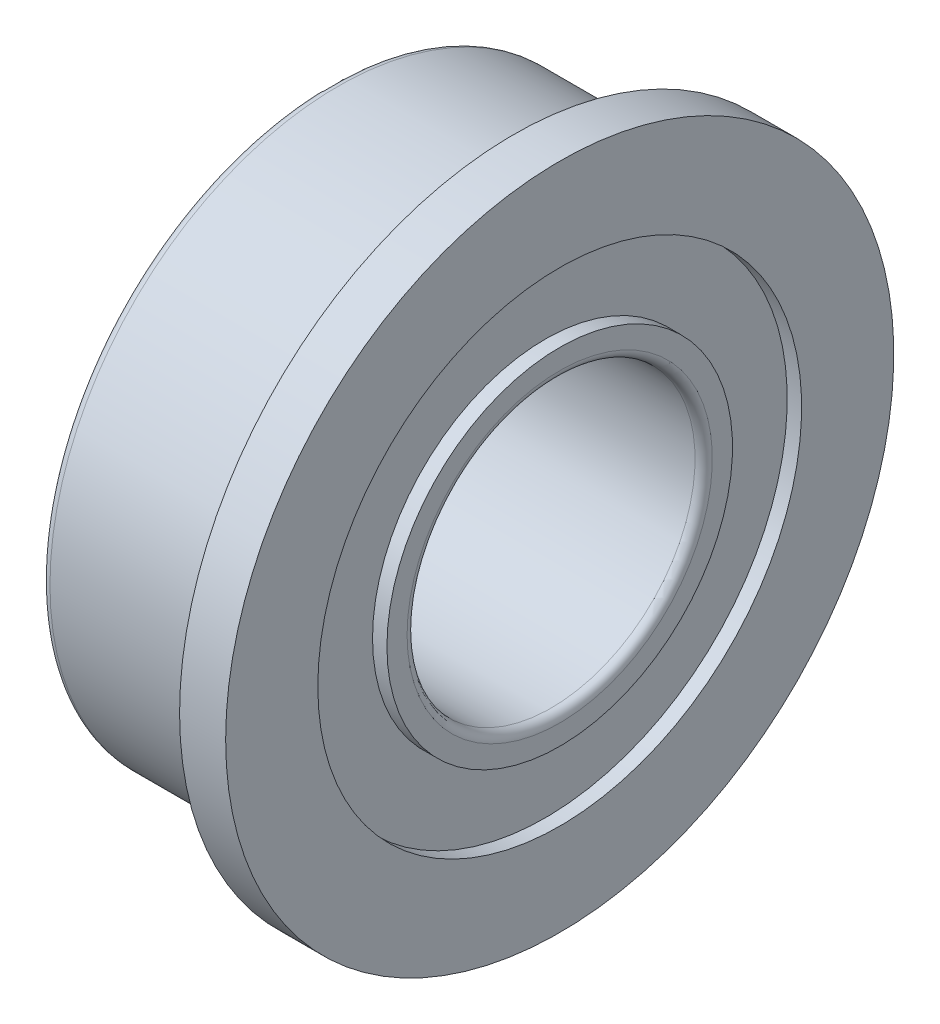
ISO-10303-21;
HEADER;
FILE_DESCRIPTION(('STEP AP214'),'2;1');
FILE_NAME('part.step','',(''),(''),'','','');
FILE_SCHEMA(('AUTOMOTIVE_DESIGN { 1 0 10303 214 1 1 1 1 }'));
ENDSEC;
DATA;
#1=APPLICATION_CONTEXT('core data for automotive mechanical design processes');
#2=APPLICATION_PROTOCOL_DEFINITION('international standard','automotive_design',2000,#1);
#3=PRODUCT_CONTEXT('',#1,'mechanical');
#4=PRODUCT('Part','Part','',(#3));
#5=PRODUCT_RELATED_PRODUCT_CATEGORY('part','',(#4));
#6=PRODUCT_DEFINITION_FORMATION('','',#4);
#7=PRODUCT_DEFINITION_CONTEXT('part definition',#1,'design');
#8=PRODUCT_DEFINITION('design','',#6,#7);
#9=PRODUCT_DEFINITION_SHAPE('','',#8);
#10=(LENGTH_UNIT() NAMED_UNIT(*) SI_UNIT(.MILLI.,.METRE.));
#11=(NAMED_UNIT(*) PLANE_ANGLE_UNIT() SI_UNIT($,.RADIAN.));
#12=(NAMED_UNIT(*) SI_UNIT($,.STERADIAN.) SOLID_ANGLE_UNIT());
#13=UNCERTAINTY_MEASURE_WITH_UNIT(LENGTH_MEASURE(1.E-05),#10,'distance_accuracy_value','');
#14=(GEOMETRIC_REPRESENTATION_CONTEXT(3) GLOBAL_UNCERTAINTY_ASSIGNED_CONTEXT((#13)) GLOBAL_UNIT_ASSIGNED_CONTEXT((#10,
#11,#12)) REPRESENTATION_CONTEXT('',''));
#15=CARTESIAN_POINT('',(0.,0.,0.));
#16=DIRECTION('',(0.,0.,1.));
#17=DIRECTION('',(1.,0.,0.));
#18=AXIS2_PLACEMENT_3D('',#15,#16,#17);
#19=CARTESIAN_POINT('',(-3.2,0.,0.));
#20=DIRECTION('',(-1.,0.,0.));
#21=DIRECTION('',(0.,0.,1.));
#22=AXIS2_PLACEMENT_3D('',#19,#20,#21);
#23=CYLINDRICAL_SURFACE('',#22,5.8);
#24=CARTESIAN_POINT('',(0.,0.,0.));
#25=DIRECTION('',(-1.,0.,0.));
#26=DIRECTION('',(0.,0.,1.));
#27=AXIS2_PLACEMENT_3D('',#24,#25,#26);
#28=CIRCLE('',#27,5.8);
#29=CARTESIAN_POINT('',(0.,0.,5.8));
#30=VERTEX_POINT('',#29);
#31=EDGE_CURVE('E57',#30,#30,#28,.T.);
#32=ORIENTED_EDGE('',*,*,#31,.F.);
#33=EDGE_LOOP('',(#32));
#34=FACE_BOUND('',#33,.T.);
#35=CARTESIAN_POINT('',(0.8,0.,0.));
#36=DIRECTION('',(-1.,0.,0.));
#37=DIRECTION('',(0.,0.,1.));
#38=AXIS2_PLACEMENT_3D('',#35,#36,#37);
#39=CIRCLE('',#38,5.8);
#40=CARTESIAN_POINT('',(0.8,0.,5.8));
#41=VERTEX_POINT('',#40);
#42=EDGE_CURVE('E90',#41,#41,#39,.T.);
#43=ORIENTED_EDGE('',*,*,#42,.T.);
#44=EDGE_LOOP('',(#43));
#45=FACE_BOUND('',#44,.T.);
#46=ADVANCED_FACE('F31',(#34,#45),#23,.T.);
#47=CARTESIAN_POINT('',(0.,5.2,0.));
#48=DIRECTION('',(1.,0.,0.));
#49=DIRECTION('',(0.,0.,-1.));
#50=AXIS2_PLACEMENT_3D('',#47,#48,#49);
#51=PLANE('',#50);
#52=CARTESIAN_POINT('',(0.,0.,0.));
#53=DIRECTION('',(-1.,0.,0.));
#54=DIRECTION('',(0.,0.,1.));
#55=AXIS2_PLACEMENT_3D('',#52,#53,#54);
#56=CIRCLE('',#55,5.2);
#57=CARTESIAN_POINT('',(0.,0.,5.2));
#58=VERTEX_POINT('',#57);
#59=EDGE_CURVE('E60',#58,#58,#56,.T.);
#60=ORIENTED_EDGE('',*,*,#59,.F.);
#61=EDGE_LOOP('',(#60));
#62=FACE_BOUND('',#61,.T.);
#63=ORIENTED_EDGE('',*,*,#31,.T.);
#64=EDGE_LOOP('',(#63));
#65=FACE_BOUND('',#64,.T.);
#66=ADVANCED_FACE('F132',(#62,#65),#51,.F.);
#67=CARTESIAN_POINT('',(0.,0.,0.));
#68=DIRECTION('',(-1.,0.,0.));
#69=DIRECTION('',(0.,0.,1.));
#70=AXIS2_PLACEMENT_3D('',#67,#68,#69);
#71=TOROIDAL_SURFACE('',#70,5.,0.2);
#72=CARTESIAN_POINT('',(-0.2,0.,0.));
#73=DIRECTION('',(-1.,0.,0.));
#74=DIRECTION('',(0.,0.,1.));
#75=AXIS2_PLACEMENT_3D('',#72,#73,#74);
#76=CIRCLE('',#75,5.);
#77=CARTESIAN_POINT('',(-0.2,0.,5.));
#78=VERTEX_POINT('',#77);
#79=EDGE_CURVE('E63',#78,#78,#76,.T.);
#80=ORIENTED_EDGE('',*,*,#79,.F.);
#81=EDGE_LOOP('',(#80));
#82=FACE_BOUND('',#81,.T.);
#83=ORIENTED_EDGE('',*,*,#59,.T.);
#84=EDGE_LOOP('',(#83));
#85=FACE_BOUND('',#84,.T.);
#86=ADVANCED_FACE('F138',(#82,#85),#71,.F.);
#87=CARTESIAN_POINT('',(-3.2,0.,0.));
#88=DIRECTION('',(-1.,0.,0.));
#89=DIRECTION('',(0.,0.,1.));
#90=AXIS2_PLACEMENT_3D('',#87,#88,#89);
#91=CYLINDRICAL_SURFACE('',#90,5.);
#92=CARTESIAN_POINT('',(-3.05,0.,0.));
#93=DIRECTION('',(1.,0.,0.));
#94=DIRECTION('',(0.,0.,-1.));
#95=AXIS2_PLACEMENT_3D('',#92,#93,#94);
#96=CIRCLE('',#95,5.);
#97=CARTESIAN_POINT('',(-3.05,0.,-5.));
#98=VERTEX_POINT('',#97);
#99=EDGE_CURVE('E10',#98,#98,#96,.T.);
#100=ORIENTED_EDGE('',*,*,#99,.T.);
#101=EDGE_LOOP('',(#100));
#102=FACE_BOUND('',#101,.T.);
#103=ORIENTED_EDGE('',*,*,#79,.T.);
#104=EDGE_LOOP('',(#103));
#105=FACE_BOUND('',#104,.T.);
#106=ADVANCED_FACE('F183',(#102,#105),#91,.T.);
#107=CARTESIAN_POINT('',(-3.2,4.2,0.));
#108=DIRECTION('',(1.,0.,0.));
#109=DIRECTION('',(0.,0.,-1.));
#110=AXIS2_PLACEMENT_3D('',#107,#108,#109);
#111=PLANE('',#110);
#112=CARTESIAN_POINT('',(-3.2,0.,0.));
#113=DIRECTION('',(1.,0.,0.));
#114=DIRECTION('',(0.,0.,-1.));
#115=AXIS2_PLACEMENT_3D('',#112,#113,#114);
#116=CIRCLE('',#115,4.85);
#117=CARTESIAN_POINT('',(-3.2,0.,-4.85));
#118=VERTEX_POINT('',#117);
#119=EDGE_CURVE('E38',#118,#118,#116,.F.);
#120=ORIENTED_EDGE('',*,*,#119,.T.);
#121=EDGE_LOOP('',(#120));
#122=FACE_BOUND('',#121,.T.);
#123=CARTESIAN_POINT('',(-3.2,0.,0.));
#124=DIRECTION('',(-1.,0.,0.));
#125=DIRECTION('',(0.,0.,1.));
#126=AXIS2_PLACEMENT_3D('',#123,#124,#125);
#127=CIRCLE('',#126,4.2);
#128=CARTESIAN_POINT('',(-3.2,0.,4.2));
#129=VERTEX_POINT('',#128);
#130=EDGE_CURVE('E66',#129,#129,#127,.T.);
#131=ORIENTED_EDGE('',*,*,#130,.F.);
#132=EDGE_LOOP('',(#131));
#133=FACE_BOUND('',#132,.T.);
#134=ADVANCED_FACE('F178',(#122,#133),#111,.F.);
#135=CARTESIAN_POINT('',(-3.2,0.,0.));
#136=DIRECTION('',(-1.,0.,0.));
#137=DIRECTION('',(0.,0.,1.));
#138=AXIS2_PLACEMENT_3D('',#135,#136,#137);
#139=CYLINDRICAL_SURFACE('',#138,4.2);
#140=CARTESIAN_POINT('',(-2.95,0.,0.));
#141=DIRECTION('',(-1.,0.,0.));
#142=DIRECTION('',(0.,0.,1.));
#143=AXIS2_PLACEMENT_3D('',#140,#141,#142);
#144=CIRCLE('',#143,4.2);
#145=CARTESIAN_POINT('',(-2.95,0.,4.2));
#146=VERTEX_POINT('',#145);
#147=EDGE_CURVE('E69',#146,#146,#144,.T.);
#148=ORIENTED_EDGE('',*,*,#147,.F.);
#149=EDGE_LOOP('',(#148));
#150=FACE_BOUND('',#149,.T.);
#151=ORIENTED_EDGE('',*,*,#130,.T.);
#152=EDGE_LOOP('',(#151));
#153=FACE_BOUND('',#152,.T.);
#154=ADVANCED_FACE('F172',(#150,#153),#139,.F.);
#155=CARTESIAN_POINT('',(-2.95,4.2,0.));
#156=DIRECTION('',(1.,0.,0.));
#157=DIRECTION('',(0.,0.,-1.));
#158=AXIS2_PLACEMENT_3D('',#155,#156,#157);
#159=PLANE('',#158);
#160=CARTESIAN_POINT('',(-2.95,0.,0.));
#161=DIRECTION('',(-1.,0.,0.));
#162=DIRECTION('',(0.,0.,1.));
#163=AXIS2_PLACEMENT_3D('',#160,#161,#162);
#164=CIRCLE('',#163,3.);
#165=CARTESIAN_POINT('',(-2.95,0.,3.));
#166=VERTEX_POINT('',#165);
#167=EDGE_CURVE('E72',#166,#166,#164,.T.);
#168=ORIENTED_EDGE('',*,*,#167,.F.);
#169=EDGE_LOOP('',(#168));
#170=FACE_BOUND('',#169,.T.);
#171=ORIENTED_EDGE('',*,*,#147,.T.);
#172=EDGE_LOOP('',(#171));
#173=FACE_BOUND('',#172,.T.);
#174=ADVANCED_FACE('F166',(#170,#173),#159,.F.);
#175=CARTESIAN_POINT('',(-3.2,0.,0.));
#176=DIRECTION('',(-1.,0.,0.));
#177=DIRECTION('',(0.,0.,1.));
#178=AXIS2_PLACEMENT_3D('',#175,#176,#177);
#179=CYLINDRICAL_SURFACE('',#178,3.);
#180=CARTESIAN_POINT('',(-3.2,0.,0.));
#181=DIRECTION('',(-1.,0.,0.));
#182=DIRECTION('',(0.,0.,1.));
#183=AXIS2_PLACEMENT_3D('',#180,#181,#182);
#184=CIRCLE('',#183,3.);
#185=CARTESIAN_POINT('',(-3.2,0.,3.));
#186=VERTEX_POINT('',#185);
#187=EDGE_CURVE('E75',#186,#186,#184,.T.);
#188=ORIENTED_EDGE('',*,*,#187,.F.);
#189=EDGE_LOOP('',(#188));
#190=FACE_BOUND('',#189,.T.);
#191=ORIENTED_EDGE('',*,*,#167,.T.);
#192=EDGE_LOOP('',(#191));
#193=FACE_BOUND('',#192,.T.);
#194=ADVANCED_FACE('F160',(#190,#193),#179,.T.);
#195=CARTESIAN_POINT('',(-3.2,2.5,0.));
#196=DIRECTION('',(1.,0.,0.));
#197=DIRECTION('',(0.,0.,-1.));
#198=AXIS2_PLACEMENT_3D('',#195,#196,#197);
#199=PLANE('',#198);
#200=CARTESIAN_POINT('',(-3.2,0.,0.));
#201=DIRECTION('',(1.,0.,0.));
#202=DIRECTION('',(0.,0.,-1.));
#203=AXIS2_PLACEMENT_3D('',#200,#201,#202);
#204=CIRCLE('',#203,2.65);
#205=CARTESIAN_POINT('',(-3.2,0.,-2.65));
#206=VERTEX_POINT('',#205);
#207=EDGE_CURVE('E42',#206,#206,#204,.T.);
#208=ORIENTED_EDGE('',*,*,#207,.T.);
#209=EDGE_LOOP('',(#208));
#210=FACE_BOUND('',#209,.T.);
#211=ORIENTED_EDGE('',*,*,#187,.T.);
#212=EDGE_LOOP('',(#211));
#213=FACE_BOUND('',#212,.T.);
#214=ADVANCED_FACE('F128',(#210,#213),#199,.F.);
#215=CARTESIAN_POINT('',(-3.2,0.,0.));
#216=DIRECTION('',(-1.,0.,0.));
#217=DIRECTION('',(0.,0.,1.));
#218=AXIS2_PLACEMENT_3D('',#215,#216,#217);
#219=CYLINDRICAL_SURFACE('',#218,2.5);
#220=CARTESIAN_POINT('',(0.65,0.,0.));
#221=DIRECTION('',(-1.,0.,0.));
#222=DIRECTION('',(0.,0.,1.));
#223=AXIS2_PLACEMENT_3D('',#220,#221,#222);
#224=CIRCLE('',#223,2.5);
#225=CARTESIAN_POINT('',(0.65,0.,2.5));
#226=VERTEX_POINT('',#225);
#227=EDGE_CURVE('E46',#226,#226,#224,.F.);
#228=ORIENTED_EDGE('',*,*,#227,.T.);
#229=EDGE_LOOP('',(#228));
#230=FACE_BOUND('',#229,.T.);
#231=CARTESIAN_POINT('',(-3.05,0.,0.));
#232=DIRECTION('',(1.,0.,0.));
#233=DIRECTION('',(0.,0.,-1.));
#234=AXIS2_PLACEMENT_3D('',#231,#232,#233);
#235=CIRCLE('',#234,2.5);
#236=CARTESIAN_POINT('',(-3.05,0.,-2.5));
#237=VERTEX_POINT('',#236);
#238=EDGE_CURVE('E51',#237,#237,#235,.F.);
#239=ORIENTED_EDGE('',*,*,#238,.T.);
#240=EDGE_LOOP('',(#239));
#241=FACE_BOUND('',#240,.T.);
#242=ADVANCED_FACE('F122',(#230,#241),#219,.F.);
#243=CARTESIAN_POINT('',(0.8,3.,0.));
#244=DIRECTION('',(-1.,0.,0.));
#245=DIRECTION('',(0.,0.,1.));
#246=AXIS2_PLACEMENT_3D('',#243,#244,#245);
#247=PLANE('',#246);
#248=CARTESIAN_POINT('',(0.8,0.,0.));
#249=DIRECTION('',(-1.,0.,0.));
#250=DIRECTION('',(0.,0.,1.));
#251=AXIS2_PLACEMENT_3D('',#248,#249,#250);
#252=CIRCLE('',#251,2.65);
#253=CARTESIAN_POINT('',(0.8,0.,2.65));
#254=VERTEX_POINT('',#253);
#255=EDGE_CURVE('E54',#254,#254,#252,.T.);
#256=ORIENTED_EDGE('',*,*,#255,.T.);
#257=EDGE_LOOP('',(#256));
#258=FACE_BOUND('',#257,.T.);
#259=CARTESIAN_POINT('',(0.8,0.,0.));
#260=DIRECTION('',(-1.,0.,0.));
#261=DIRECTION('',(0.,0.,1.));
#262=AXIS2_PLACEMENT_3D('',#259,#260,#261);
#263=CIRCLE('',#262,3.);
#264=CARTESIAN_POINT('',(0.8,0.,3.));
#265=VERTEX_POINT('',#264);
#266=EDGE_CURVE('E78',#265,#265,#263,.T.);
#267=ORIENTED_EDGE('',*,*,#266,.F.);
#268=EDGE_LOOP('',(#267));
#269=FACE_BOUND('',#268,.T.);
#270=ADVANCED_FACE('F117',(#258,#269),#247,.F.);
#271=CARTESIAN_POINT('',(-3.2,0.,0.));
#272=DIRECTION('',(-1.,0.,0.));
#273=DIRECTION('',(0.,0.,1.));
#274=AXIS2_PLACEMENT_3D('',#271,#272,#273);
#275=CYLINDRICAL_SURFACE('',#274,3.);
#276=CARTESIAN_POINT('',(0.55,0.,0.));
#277=DIRECTION('',(-1.,0.,0.));
#278=DIRECTION('',(0.,0.,1.));
#279=AXIS2_PLACEMENT_3D('',#276,#277,#278);
#280=CIRCLE('',#279,3.);
#281=CARTESIAN_POINT('',(0.55,0.,3.));
#282=VERTEX_POINT('',#281);
#283=EDGE_CURVE('E81',#282,#282,#280,.T.);
#284=ORIENTED_EDGE('',*,*,#283,.F.);
#285=EDGE_LOOP('',(#284));
#286=FACE_BOUND('',#285,.T.);
#287=ORIENTED_EDGE('',*,*,#266,.T.);
#288=EDGE_LOOP('',(#287));
#289=FACE_BOUND('',#288,.T.);
#290=ADVANCED_FACE('F111',(#286,#289),#275,.T.);
#291=CARTESIAN_POINT('',(0.549999999999999,4.2,0.));
#292=DIRECTION('',(-1.,0.,0.));
#293=DIRECTION('',(0.,0.,1.));
#294=AXIS2_PLACEMENT_3D('',#291,#292,#293);
#295=PLANE('',#294);
#296=CARTESIAN_POINT('',(0.549999999999999,0.,0.));
#297=DIRECTION('',(-1.,0.,0.));
#298=DIRECTION('',(0.,0.,1.));
#299=AXIS2_PLACEMENT_3D('',#296,#297,#298);
#300=CIRCLE('',#299,4.2);
#301=CARTESIAN_POINT('',(0.549999999999999,0.,4.2));
#302=VERTEX_POINT('',#301);
#303=EDGE_CURVE('E84',#302,#302,#300,.T.);
#304=ORIENTED_EDGE('',*,*,#303,.F.);
#305=EDGE_LOOP('',(#304));
#306=FACE_BOUND('',#305,.T.);
#307=ORIENTED_EDGE('',*,*,#283,.T.);
#308=EDGE_LOOP('',(#307));
#309=FACE_BOUND('',#308,.T.);
#310=ADVANCED_FACE('F105',(#306,#309),#295,.F.);
#311=CARTESIAN_POINT('',(-3.2,0.,0.));
#312=DIRECTION('',(-1.,0.,0.));
#313=DIRECTION('',(0.,0.,1.));
#314=AXIS2_PLACEMENT_3D('',#311,#312,#313);
#315=CYLINDRICAL_SURFACE('',#314,4.2);
#316=CARTESIAN_POINT('',(0.8,0.,0.));
#317=DIRECTION('',(-1.,0.,0.));
#318=DIRECTION('',(0.,0.,1.));
#319=AXIS2_PLACEMENT_3D('',#316,#317,#318);
#320=CIRCLE('',#319,4.2);
#321=CARTESIAN_POINT('',(0.8,0.,4.2));
#322=VERTEX_POINT('',#321);
#323=EDGE_CURVE('E87',#322,#322,#320,.T.);
#324=ORIENTED_EDGE('',*,*,#323,.F.);
#325=EDGE_LOOP('',(#324));
#326=FACE_BOUND('',#325,.T.);
#327=ORIENTED_EDGE('',*,*,#303,.T.);
#328=EDGE_LOOP('',(#327));
#329=FACE_BOUND('',#328,.T.);
#330=ADVANCED_FACE('F99',(#326,#329),#315,.F.);
#331=CARTESIAN_POINT('',(0.8,5.8,0.));
#332=DIRECTION('',(-1.,0.,0.));
#333=DIRECTION('',(0.,0.,1.));
#334=AXIS2_PLACEMENT_3D('',#331,#332,#333);
#335=PLANE('',#334);
#336=ORIENTED_EDGE('',*,*,#42,.F.);
#337=EDGE_LOOP('',(#336));
#338=FACE_BOUND('',#337,.T.);
#339=ORIENTED_EDGE('',*,*,#323,.T.);
#340=EDGE_LOOP('',(#339));
#341=FACE_BOUND('',#340,.T.);
#342=ADVANCED_FACE('F95',(#338,#341),#335,.F.);
#343=CARTESIAN_POINT('',(0.65,0.,0.));
#344=DIRECTION('',(-1.,0.,0.));
#345=DIRECTION('',(0.,0.,1.));
#346=AXIS2_PLACEMENT_3D('',#343,#344,#345);
#347=TOROIDAL_SURFACE('',#346,2.65,0.15);
#348=ORIENTED_EDGE('',*,*,#227,.F.);
#349=EDGE_LOOP('',(#348));
#350=FACE_BOUND('',#349,.T.);
#351=ORIENTED_EDGE('',*,*,#255,.F.);
#352=EDGE_LOOP('',(#351));
#353=FACE_BOUND('',#352,.T.);
#354=ADVANCED_FACE('F98',(#350,#353),#347,.T.);
#355=CARTESIAN_POINT('',(-3.05,0.,0.));
#356=DIRECTION('',(1.,0.,0.));
#357=DIRECTION('',(0.,0.,-1.));
#358=AXIS2_PLACEMENT_3D('',#355,#356,#357);
#359=TOROIDAL_SURFACE('',#358,2.65,0.15);
#360=ORIENTED_EDGE('',*,*,#207,.F.);
#361=EDGE_LOOP('',(#360));
#362=FACE_BOUND('',#361,.T.);
#363=ORIENTED_EDGE('',*,*,#238,.F.);
#364=EDGE_LOOP('',(#363));
#365=FACE_BOUND('',#364,.T.);
#366=ADVANCED_FACE('F145',(#362,#365),#359,.T.);
#367=CARTESIAN_POINT('',(-3.05,0.,0.));
#368=DIRECTION('',(1.,0.,0.));
#369=DIRECTION('',(0.,0.,-1.));
#370=AXIS2_PLACEMENT_3D('',#367,#368,#369);
#371=TOROIDAL_SURFACE('',#370,4.85,0.15);
#372=ORIENTED_EDGE('',*,*,#99,.F.);
#373=EDGE_LOOP('',(#372));
#374=FACE_BOUND('',#373,.T.);
#375=ORIENTED_EDGE('',*,*,#119,.F.);
#376=EDGE_LOOP('',(#375));
#377=FACE_BOUND('',#376,.T.);
#378=ADVANCED_FACE('F33',(#374,#377),#371,.T.);
#379=CLOSED_SHELL('',(#46,#66,#86,#106,#134,#154,#174,#194,#214,#242,#270,#290,#310,#330,#342,
#354,#366,#378));
#380=MANIFOLD_SOLID_BREP('B2',#379);
#381=ADVANCED_BREP_SHAPE_REPRESENTATION('',(#18,#380),#14);
#382=SHAPE_DEFINITION_REPRESENTATION(#9,#381);
ENDSEC;
END-ISO-10303-21;
